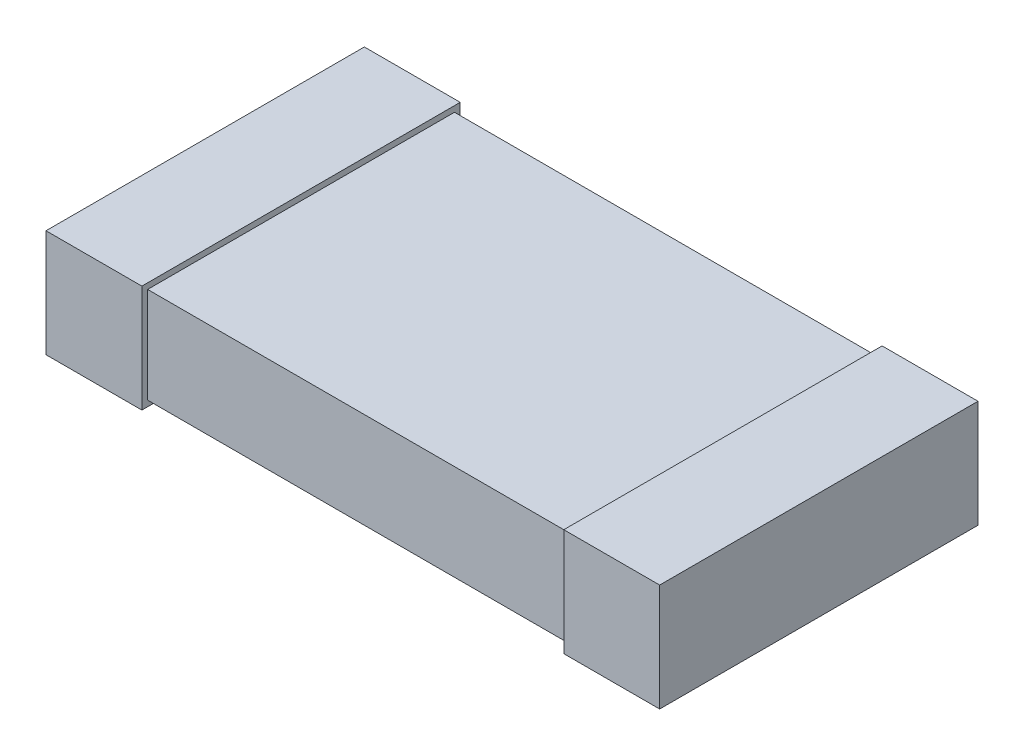
ISO-10303-21;
HEADER;
FILE_DESCRIPTION(('STEP AP214'),'2;1');
FILE_NAME('part.step','',(''),(''),'','','');
FILE_SCHEMA(('AUTOMOTIVE_DESIGN { 1 0 10303 214 1 1 1 1 }'));
ENDSEC;
DATA;
#1=APPLICATION_CONTEXT('core data for automotive mechanical design processes');
#2=APPLICATION_PROTOCOL_DEFINITION('international standard','automotive_design',2000,#1);
#3=PRODUCT_CONTEXT('',#1,'mechanical');
#4=PRODUCT('Part','Part','',(#3));
#5=PRODUCT_RELATED_PRODUCT_CATEGORY('part','',(#4));
#6=PRODUCT_DEFINITION_FORMATION('','',#4);
#7=PRODUCT_DEFINITION_CONTEXT('part definition',#1,'design');
#8=PRODUCT_DEFINITION('design','',#6,#7);
#9=PRODUCT_DEFINITION_SHAPE('','',#8);
#10=(LENGTH_UNIT() NAMED_UNIT(*) SI_UNIT(.MILLI.,.METRE.));
#11=(NAMED_UNIT(*) PLANE_ANGLE_UNIT() SI_UNIT($,.RADIAN.));
#12=(NAMED_UNIT(*) SI_UNIT($,.STERADIAN.) SOLID_ANGLE_UNIT());
#13=UNCERTAINTY_MEASURE_WITH_UNIT(LENGTH_MEASURE(1.E-05),#10,'distance_accuracy_value','');
#14=(GEOMETRIC_REPRESENTATION_CONTEXT(3) GLOBAL_UNCERTAINTY_ASSIGNED_CONTEXT((#13)) GLOBAL_UNIT_ASSIGNED_CONTEXT((#10,
#11,#12)) REPRESENTATION_CONTEXT('',''));
#15=CARTESIAN_POINT('',(0.,0.,0.));
#16=DIRECTION('',(0.,0.,1.));
#17=DIRECTION('',(1.,0.,0.));
#18=AXIS2_PLACEMENT_3D('',#15,#16,#17);
#19=CARTESIAN_POINT('',(-1.6,0.5,0.8));
#20=DIRECTION('',(0.,0.,-1.));
#21=DIRECTION('',(-1.,0.,0.));
#22=AXIS2_PLACEMENT_3D('',#19,#20,#21);
#23=PLANE('',#22);
#24=DIRECTION('',(0.,-1.,0.));
#25=VECTOR('',#24,1.);
#26=CARTESIAN_POINT('',(1.1,0.5,0.8));
#27=LINE('',#26,#25);
#28=CARTESIAN_POINT('',(1.1,0.5,0.8));
#29=VERTEX_POINT('',#28);
#30=CARTESIAN_POINT('',(1.1,0.,0.8));
#31=VERTEX_POINT('',#30);
#32=EDGE_CURVE('E51',#29,#31,#27,.T.);
#33=ORIENTED_EDGE('',*,*,#32,.F.);
#34=DIRECTION('',(1.,0.,0.));
#35=VECTOR('',#34,1.);
#36=CARTESIAN_POINT('',(-1.6,0.5,0.8));
#37=LINE('',#36,#35);
#38=CARTESIAN_POINT('',(-1.1,0.5,0.8));
#39=VERTEX_POINT('',#38);
#40=EDGE_CURVE('E216',#39,#29,#37,.T.);
#41=ORIENTED_EDGE('',*,*,#40,.F.);
#42=DIRECTION('',(0.,1.,0.));
#43=VECTOR('',#42,1.);
#44=CARTESIAN_POINT('',(-1.1,0.5,0.8));
#45=LINE('',#44,#43);
#46=CARTESIAN_POINT('',(-1.1,0.,0.8));
#47=VERTEX_POINT('',#46);
#48=EDGE_CURVE('E210',#47,#39,#45,.T.);
#49=ORIENTED_EDGE('',*,*,#48,.F.);
#50=DIRECTION('',(1.,0.,0.));
#51=VECTOR('',#50,1.);
#52=CARTESIAN_POINT('',(-1.6,0.,0.8));
#53=LINE('',#52,#51);
#54=EDGE_CURVE('E215',#47,#31,#53,.T.);
#55=ORIENTED_EDGE('',*,*,#54,.T.);
#56=EDGE_LOOP('',(#33,#41,#49,#55));
#57=FACE_BOUND('',#56,.T.);
#58=ADVANCED_FACE('F36',(#57),#23,.F.);
#59=CARTESIAN_POINT('',(-1.6,0.5,-0.8));
#60=DIRECTION('',(0.,0.,1.));
#61=DIRECTION('',(1.,0.,0.));
#62=AXIS2_PLACEMENT_3D('',#59,#60,#61);
#63=PLANE('',#62);
#64=DIRECTION('',(0.,1.,0.));
#65=VECTOR('',#64,1.);
#66=CARTESIAN_POINT('',(1.1,0.5,-0.8));
#67=LINE('',#66,#65);
#68=CARTESIAN_POINT('',(1.1,0.,-0.8));
#69=VERTEX_POINT('',#68);
#70=CARTESIAN_POINT('',(1.1,0.5,-0.8));
#71=VERTEX_POINT('',#70);
#72=EDGE_CURVE('E165',#69,#71,#67,.T.);
#73=ORIENTED_EDGE('',*,*,#72,.F.);
#74=DIRECTION('',(-1.,0.,0.));
#75=VECTOR('',#74,1.);
#76=CARTESIAN_POINT('',(-1.6,0.,-0.8));
#77=LINE('',#76,#75);
#78=CARTESIAN_POINT('',(-1.1,0.,-0.8));
#79=VERTEX_POINT('',#78);
#80=EDGE_CURVE('E219',#69,#79,#77,.T.);
#81=ORIENTED_EDGE('',*,*,#80,.T.);
#82=DIRECTION('',(0.,-1.,0.));
#83=VECTOR('',#82,1.);
#84=CARTESIAN_POINT('',(-1.1,0.5,-0.8));
#85=LINE('',#84,#83);
#86=CARTESIAN_POINT('',(-1.1,0.5,-0.8));
#87=VERTEX_POINT('',#86);
#88=EDGE_CURVE('E198',#87,#79,#85,.T.);
#89=ORIENTED_EDGE('',*,*,#88,.F.);
#90=DIRECTION('',(-1.,0.,0.));
#91=VECTOR('',#90,1.);
#92=CARTESIAN_POINT('',(-1.6,0.5,-0.8));
#93=LINE('',#92,#91);
#94=EDGE_CURVE('E218',#71,#87,#93,.T.);
#95=ORIENTED_EDGE('',*,*,#94,.F.);
#96=EDGE_LOOP('',(#73,#81,#89,#95));
#97=FACE_BOUND('',#96,.T.);
#98=ADVANCED_FACE('F236',(#97),#63,.F.);
#99=CARTESIAN_POINT('',(-1.6,0.5,0.8));
#100=DIRECTION('',(0.,1.,0.));
#101=DIRECTION('',(0.,0.,1.));
#102=AXIS2_PLACEMENT_3D('',#99,#100,#101);
#103=PLANE('',#102);
#104=ORIENTED_EDGE('',*,*,#40,.T.);
#105=DIRECTION('',(0.,0.,-1.));
#106=VECTOR('',#105,1.);
#107=CARTESIAN_POINT('',(1.1,0.5,0.8));
#108=LINE('',#107,#106);
#109=EDGE_CURVE('E58',#29,#71,#108,.T.);
#110=ORIENTED_EDGE('',*,*,#109,.T.);
#111=ORIENTED_EDGE('',*,*,#94,.T.);
#112=DIRECTION('',(0.,0.,1.));
#113=VECTOR('',#112,1.);
#114=CARTESIAN_POINT('',(-1.1,0.5,0.8));
#115=LINE('',#114,#113);
#116=EDGE_CURVE('E213',#87,#39,#115,.T.);
#117=ORIENTED_EDGE('',*,*,#116,.T.);
#118=EDGE_LOOP('',(#104,#110,#111,#117));
#119=FACE_BOUND('',#118,.T.);
#120=ADVANCED_FACE('F233',(#119),#103,.T.);
#121=CARTESIAN_POINT('',(-1.6,0.,0.8));
#122=DIRECTION('',(0.,1.,0.));
#123=DIRECTION('',(0.,0.,1.));
#124=AXIS2_PLACEMENT_3D('',#121,#122,#123);
#125=PLANE('',#124);
#126=DIRECTION('',(0.,0.,-1.));
#127=VECTOR('',#126,1.);
#128=CARTESIAN_POINT('',(1.1,0.,0.8));
#129=LINE('',#128,#127);
#130=EDGE_CURVE('E12',#31,#69,#129,.T.);
#131=ORIENTED_EDGE('',*,*,#130,.F.);
#132=ORIENTED_EDGE('',*,*,#54,.F.);
#133=DIRECTION('',(0.,0.,1.));
#134=VECTOR('',#133,1.);
#135=CARTESIAN_POINT('',(-1.1,0.,0.8));
#136=LINE('',#135,#134);
#137=EDGE_CURVE('E44',#79,#47,#136,.T.);
#138=ORIENTED_EDGE('',*,*,#137,.F.);
#139=ORIENTED_EDGE('',*,*,#80,.F.);
#140=EDGE_LOOP('',(#131,#132,#138,#139));
#141=FACE_BOUND('',#140,.T.);
#142=ADVANCED_FACE('F231',(#141),#125,.F.);
#143=CARTESIAN_POINT('',(-1.1,-0.03,1.61073297516494));
#144=DIRECTION('',(0.,1.,0.));
#145=DIRECTION('',(-1.,0.,0.));
#146=AXIS2_PLACEMENT_3D('',#143,#144,#145);
#147=PLANE('',#146);
#148=DIRECTION('',(0.,0.,-1.));
#149=VECTOR('',#148,1.);
#150=CARTESIAN_POINT('',(-1.1,-0.03,1.61073297516494));
#151=LINE('',#150,#149);
#152=CARTESIAN_POINT('',(-1.1,-0.03,0.83));
#153=VERTEX_POINT('',#152);
#154=CARTESIAN_POINT('',(-1.1,-0.03,-0.83));
#155=VERTEX_POINT('',#154);
#156=EDGE_CURVE('E187',#153,#155,#151,.T.);
#157=ORIENTED_EDGE('',*,*,#156,.F.);
#158=DIRECTION('',(-1.,0.,0.));
#159=VECTOR('',#158,1.);
#160=CARTESIAN_POINT('',(-1.1,-0.03,0.83));
#161=LINE('',#160,#159);
#162=CARTESIAN_POINT('',(-1.6,-0.0300000000000001,0.83));
#163=VERTEX_POINT('',#162);
#164=EDGE_CURVE('E192',#153,#163,#161,.T.);
#165=ORIENTED_EDGE('',*,*,#164,.T.);
#166=DIRECTION('',(0.,0.,-1.));
#167=VECTOR('',#166,1.);
#168=CARTESIAN_POINT('',(-1.6,-0.0300000000000001,1.61073297516494));
#169=LINE('',#168,#167);
#170=CARTESIAN_POINT('',(-1.6,-0.0300000000000001,-0.83));
#171=VERTEX_POINT('',#170);
#172=EDGE_CURVE('E200',#163,#171,#169,.T.);
#173=ORIENTED_EDGE('',*,*,#172,.T.);
#174=DIRECTION('',(-1.,0.,0.));
#175=VECTOR('',#174,1.);
#176=CARTESIAN_POINT('',(-1.1,-0.03,-0.83));
#177=LINE('',#176,#175);
#178=EDGE_CURVE('E178',#155,#171,#177,.T.);
#179=ORIENTED_EDGE('',*,*,#178,.F.);
#180=EDGE_LOOP('',(#157,#165,#173,#179));
#181=FACE_BOUND('',#180,.T.);
#182=ADVANCED_FACE('F277',(#181),#147,.F.);
#183=CARTESIAN_POINT('',(-1.1,0.53,1.61073297516494));
#184=DIRECTION('',(0.,-1.,0.));
#185=DIRECTION('',(1.,0.,0.));
#186=AXIS2_PLACEMENT_3D('',#183,#184,#185);
#187=PLANE('',#186);
#188=DIRECTION('',(0.,0.,-1.));
#189=VECTOR('',#188,1.);
#190=CARTESIAN_POINT('',(-1.6,0.53,1.61073297516494));
#191=LINE('',#190,#189);
#192=CARTESIAN_POINT('',(-1.6,0.53,0.83));
#193=VERTEX_POINT('',#192);
#194=CARTESIAN_POINT('',(-1.6,0.53,-0.83));
#195=VERTEX_POINT('',#194);
#196=EDGE_CURVE('E202',#193,#195,#191,.T.);
#197=ORIENTED_EDGE('',*,*,#196,.F.);
#198=DIRECTION('',(1.,0.,0.));
#199=VECTOR('',#198,1.);
#200=CARTESIAN_POINT('',(-1.1,0.53,0.83));
#201=LINE('',#200,#199);
#202=CARTESIAN_POINT('',(-1.1,0.53,0.83));
#203=VERTEX_POINT('',#202);
#204=EDGE_CURVE('E191',#193,#203,#201,.T.);
#205=ORIENTED_EDGE('',*,*,#204,.T.);
#206=DIRECTION('',(0.,0.,-1.));
#207=VECTOR('',#206,1.);
#208=CARTESIAN_POINT('',(-1.1,0.53,1.61073297516494));
#209=LINE('',#208,#207);
#210=CARTESIAN_POINT('',(-1.1,0.53,-0.83));
#211=VERTEX_POINT('',#210);
#212=EDGE_CURVE('E204',#203,#211,#209,.T.);
#213=ORIENTED_EDGE('',*,*,#212,.T.);
#214=DIRECTION('',(1.,0.,0.));
#215=VECTOR('',#214,1.);
#216=CARTESIAN_POINT('',(-1.1,0.53,-0.83));
#217=LINE('',#216,#215);
#218=EDGE_CURVE('E184',#195,#211,#217,.T.);
#219=ORIENTED_EDGE('',*,*,#218,.F.);
#220=EDGE_LOOP('',(#197,#205,#213,#219));
#221=FACE_BOUND('',#220,.T.);
#222=ADVANCED_FACE('F280',(#221),#187,.F.);
#223=CARTESIAN_POINT('',(-1.1,0.53,1.61073297516494));
#224=DIRECTION('',(-1.,0.,0.));
#225=DIRECTION('',(0.,0.,1.));
#226=AXIS2_PLACEMENT_3D('',#223,#224,#225);
#227=PLANE('',#226);
#228=ORIENTED_EDGE('',*,*,#116,.F.);
#229=ORIENTED_EDGE('',*,*,#88,.T.);
#230=ORIENTED_EDGE('',*,*,#137,.T.);
#231=ORIENTED_EDGE('',*,*,#48,.T.);
#232=EDGE_LOOP('',(#228,#229,#230,#231));
#233=FACE_BOUND('',#232,.T.);
#234=ORIENTED_EDGE('',*,*,#212,.F.);
#235=DIRECTION('',(0.,-1.,0.));
#236=VECTOR('',#235,1.);
#237=CARTESIAN_POINT('',(-1.1,0.53,0.83));
#238=LINE('',#237,#236);
#239=EDGE_CURVE('E195',#203,#153,#238,.T.);
#240=ORIENTED_EDGE('',*,*,#239,.T.);
#241=ORIENTED_EDGE('',*,*,#156,.T.);
#242=DIRECTION('',(0.,-1.,0.));
#243=VECTOR('',#242,1.);
#244=CARTESIAN_POINT('',(-1.1,0.53,-0.83));
#245=LINE('',#244,#243);
#246=EDGE_CURVE('E181',#211,#155,#245,.T.);
#247=ORIENTED_EDGE('',*,*,#246,.F.);
#248=EDGE_LOOP('',(#234,#240,#241,#247));
#249=FACE_BOUND('',#248,.T.);
#250=ADVANCED_FACE('F226',(#233,#249),#227,.F.);
#251=CARTESIAN_POINT('',(-1.6,0.5,0.83));
#252=DIRECTION('',(0.,0.,-1.));
#253=DIRECTION('',(-1.,0.,0.));
#254=AXIS2_PLACEMENT_3D('',#251,#252,#253);
#255=PLANE('',#254);
#256=ORIENTED_EDGE('',*,*,#204,.F.);
#257=DIRECTION('',(0.,1.,0.));
#258=VECTOR('',#257,1.);
#259=CARTESIAN_POINT('',(-1.6,0.53,0.83));
#260=LINE('',#259,#258);
#261=EDGE_CURVE('E188',#163,#193,#260,.T.);
#262=ORIENTED_EDGE('',*,*,#261,.F.);
#263=ORIENTED_EDGE('',*,*,#164,.F.);
#264=ORIENTED_EDGE('',*,*,#239,.F.);
#265=EDGE_LOOP('',(#256,#262,#263,#264));
#266=FACE_BOUND('',#265,.T.);
#267=ADVANCED_FACE('F272',(#266),#255,.F.);
#268=CARTESIAN_POINT('',(-1.6,0.5,-0.83));
#269=DIRECTION('',(0.,0.,1.));
#270=DIRECTION('',(1.,0.,0.));
#271=AXIS2_PLACEMENT_3D('',#268,#269,#270);
#272=PLANE('',#271);
#273=ORIENTED_EDGE('',*,*,#246,.T.);
#274=ORIENTED_EDGE('',*,*,#178,.T.);
#275=DIRECTION('',(0.,1.,0.));
#276=VECTOR('',#275,1.);
#277=CARTESIAN_POINT('',(-1.6,0.53,-0.83));
#278=LINE('',#277,#276);
#279=EDGE_CURVE('E175',#171,#195,#278,.T.);
#280=ORIENTED_EDGE('',*,*,#279,.T.);
#281=ORIENTED_EDGE('',*,*,#218,.T.);
#282=EDGE_LOOP('',(#273,#274,#280,#281));
#283=FACE_BOUND('',#282,.T.);
#284=ADVANCED_FACE('F269',(#283),#272,.F.);
#285=CARTESIAN_POINT('',(-1.6,0.5,-0.8));
#286=DIRECTION('',(1.,0.,0.));
#287=DIRECTION('',(0.,0.,-1.));
#288=AXIS2_PLACEMENT_3D('',#285,#286,#287);
#289=PLANE('',#288);
#290=ORIENTED_EDGE('',*,*,#172,.F.);
#291=ORIENTED_EDGE('',*,*,#261,.T.);
#292=ORIENTED_EDGE('',*,*,#196,.T.);
#293=ORIENTED_EDGE('',*,*,#279,.F.);
#294=EDGE_LOOP('',(#290,#291,#292,#293));
#295=FACE_BOUND('',#294,.T.);
#296=ADVANCED_FACE('F38',(#295),#289,.F.);
#297=CARTESIAN_POINT('',(1.1,-0.0299999999999997,1.61073297516494));
#298=DIRECTION('',(0.,1.,0.));
#299=DIRECTION('',(-1.,0.,0.));
#300=AXIS2_PLACEMENT_3D('',#297,#298,#299);
#301=PLANE('',#300);
#302=DIRECTION('',(0.,0.,-1.));
#303=VECTOR('',#302,1.);
#304=CARTESIAN_POINT('',(1.6,-0.0299999999999997,1.61073297516494));
#305=LINE('',#304,#303);
#306=CARTESIAN_POINT('',(1.6,-0.0299999999999997,0.83));
#307=VERTEX_POINT('',#306);
#308=CARTESIAN_POINT('',(1.6,-0.0299999999999997,-0.83));
#309=VERTEX_POINT('',#308);
#310=EDGE_CURVE('E138',#307,#309,#305,.T.);
#311=ORIENTED_EDGE('',*,*,#310,.F.);
#312=DIRECTION('',(-1.,0.,0.));
#313=VECTOR('',#312,1.);
#314=CARTESIAN_POINT('',(1.1,-0.0299999999999997,0.83));
#315=LINE('',#314,#313);
#316=CARTESIAN_POINT('',(1.1,-0.0299999999999997,0.83));
#317=VERTEX_POINT('',#316);
#318=EDGE_CURVE('E133',#307,#317,#315,.T.);
#319=ORIENTED_EDGE('',*,*,#318,.T.);
#320=DIRECTION('',(0.,0.,-1.));
#321=VECTOR('',#320,1.);
#322=CARTESIAN_POINT('',(1.1,-0.0299999999999997,1.61073297516494));
#323=LINE('',#322,#321);
#324=CARTESIAN_POINT('',(1.1,-0.0299999999999997,-0.83));
#325=VERTEX_POINT('',#324);
#326=EDGE_CURVE('E128',#317,#325,#323,.T.);
#327=ORIENTED_EDGE('',*,*,#326,.T.);
#328=DIRECTION('',(-1.,0.,0.));
#329=VECTOR('',#328,1.);
#330=CARTESIAN_POINT('',(1.1,-0.0299999999999997,-0.83));
#331=LINE('',#330,#329);
#332=EDGE_CURVE('E132',#309,#325,#331,.T.);
#333=ORIENTED_EDGE('',*,*,#332,.F.);
#334=EDGE_LOOP('',(#311,#319,#327,#333));
#335=FACE_BOUND('',#334,.T.);
#336=ADVANCED_FACE('F131',(#335),#301,.F.);
#337=CARTESIAN_POINT('',(1.1,0.53,1.61073297516494));
#338=DIRECTION('',(1.,0.,0.));
#339=DIRECTION('',(0.,0.,-1.));
#340=AXIS2_PLACEMENT_3D('',#337,#338,#339);
#341=PLANE('',#340);
#342=ORIENTED_EDGE('',*,*,#109,.F.);
#343=ORIENTED_EDGE('',*,*,#32,.T.);
#344=ORIENTED_EDGE('',*,*,#130,.T.);
#345=ORIENTED_EDGE('',*,*,#72,.T.);
#346=EDGE_LOOP('',(#342,#343,#344,#345));
#347=FACE_BOUND('',#346,.T.);
#348=ORIENTED_EDGE('',*,*,#326,.F.);
#349=DIRECTION('',(0.,1.,0.));
#350=VECTOR('',#349,1.);
#351=CARTESIAN_POINT('',(1.1,0.53,0.83));
#352=LINE('',#351,#350);
#353=CARTESIAN_POINT('',(1.1,0.53,0.83));
#354=VERTEX_POINT('',#353);
#355=EDGE_CURVE('E160',#317,#354,#352,.T.);
#356=ORIENTED_EDGE('',*,*,#355,.T.);
#357=DIRECTION('',(0.,0.,-1.));
#358=VECTOR('',#357,1.);
#359=CARTESIAN_POINT('',(1.1,0.53,1.61073297516494));
#360=LINE('',#359,#358);
#361=CARTESIAN_POINT('',(1.1,0.53,-0.83));
#362=VERTEX_POINT('',#361);
#363=EDGE_CURVE('E137',#354,#362,#360,.T.);
#364=ORIENTED_EDGE('',*,*,#363,.T.);
#365=DIRECTION('',(0.,1.,0.));
#366=VECTOR('',#365,1.);
#367=CARTESIAN_POINT('',(1.1,0.53,-0.83));
#368=LINE('',#367,#366);
#369=EDGE_CURVE('E145',#325,#362,#368,.T.);
#370=ORIENTED_EDGE('',*,*,#369,.F.);
#371=EDGE_LOOP('',(#348,#356,#364,#370));
#372=FACE_BOUND('',#371,.T.);
#373=ADVANCED_FACE('F150',(#347,#372),#341,.F.);
#374=CARTESIAN_POINT('',(1.1,0.53,1.61073297516494));
#375=DIRECTION('',(0.,-1.,0.));
#376=DIRECTION('',(1.,0.,0.));
#377=AXIS2_PLACEMENT_3D('',#374,#375,#376);
#378=PLANE('',#377);
#379=ORIENTED_EDGE('',*,*,#363,.F.);
#380=DIRECTION('',(1.,0.,0.));
#381=VECTOR('',#380,1.);
#382=CARTESIAN_POINT('',(1.1,0.53,0.83));
#383=LINE('',#382,#381);
#384=CARTESIAN_POINT('',(1.6,0.53,0.83));
#385=VERTEX_POINT('',#384);
#386=EDGE_CURVE('E163',#354,#385,#383,.T.);
#387=ORIENTED_EDGE('',*,*,#386,.T.);
#388=DIRECTION('',(0.,0.,-1.));
#389=VECTOR('',#388,1.);
#390=CARTESIAN_POINT('',(1.6,0.53,1.61073297516494));
#391=LINE('',#390,#389);
#392=CARTESIAN_POINT('',(1.6,0.53,-0.83));
#393=VERTEX_POINT('',#392);
#394=EDGE_CURVE('E152',#385,#393,#391,.T.);
#395=ORIENTED_EDGE('',*,*,#394,.T.);
#396=DIRECTION('',(1.,0.,0.));
#397=VECTOR('',#396,1.);
#398=CARTESIAN_POINT('',(1.1,0.53,-0.83));
#399=LINE('',#398,#397);
#400=EDGE_CURVE('E153',#362,#393,#399,.T.);
#401=ORIENTED_EDGE('',*,*,#400,.F.);
#402=EDGE_LOOP('',(#379,#387,#395,#401));
#403=FACE_BOUND('',#402,.T.);
#404=ADVANCED_FACE('F256',(#403),#378,.F.);
#405=CARTESIAN_POINT('',(-1.6,0.5,0.83));
#406=DIRECTION('',(0.,0.,-1.));
#407=DIRECTION('',(-1.,0.,0.));
#408=AXIS2_PLACEMENT_3D('',#405,#406,#407);
#409=PLANE('',#408);
#410=ORIENTED_EDGE('',*,*,#355,.F.);
#411=ORIENTED_EDGE('',*,*,#318,.F.);
#412=DIRECTION('',(0.,-1.,0.));
#413=VECTOR('',#412,1.);
#414=CARTESIAN_POINT('',(1.6,0.53,0.83));
#415=LINE('',#414,#413);
#416=EDGE_CURVE('E161',#385,#307,#415,.T.);
#417=ORIENTED_EDGE('',*,*,#416,.F.);
#418=ORIENTED_EDGE('',*,*,#386,.F.);
#419=EDGE_LOOP('',(#410,#411,#417,#418));
#420=FACE_BOUND('',#419,.T.);
#421=ADVANCED_FACE('F252',(#420),#409,.F.);
#422=CARTESIAN_POINT('',(-1.6,0.5,-0.83));
#423=DIRECTION('',(0.,0.,1.));
#424=DIRECTION('',(1.,0.,0.));
#425=AXIS2_PLACEMENT_3D('',#422,#423,#424);
#426=PLANE('',#425);
#427=ORIENTED_EDGE('',*,*,#400,.T.);
#428=DIRECTION('',(0.,-1.,0.));
#429=VECTOR('',#428,1.);
#430=CARTESIAN_POINT('',(1.6,0.53,-0.83));
#431=LINE('',#430,#429);
#432=EDGE_CURVE('E148',#393,#309,#431,.T.);
#433=ORIENTED_EDGE('',*,*,#432,.T.);
#434=ORIENTED_EDGE('',*,*,#332,.T.);
#435=ORIENTED_EDGE('',*,*,#369,.T.);
#436=EDGE_LOOP('',(#427,#433,#434,#435));
#437=FACE_BOUND('',#436,.T.);
#438=ADVANCED_FACE('F144',(#437),#426,.F.);
#439=CARTESIAN_POINT('',(1.6,0.5,-0.8));
#440=DIRECTION('',(-1.,0.,0.));
#441=DIRECTION('',(0.,0.,1.));
#442=AXIS2_PLACEMENT_3D('',#439,#440,#441);
#443=PLANE('',#442);
#444=ORIENTED_EDGE('',*,*,#394,.F.);
#445=ORIENTED_EDGE('',*,*,#416,.T.);
#446=ORIENTED_EDGE('',*,*,#310,.T.);
#447=ORIENTED_EDGE('',*,*,#432,.F.);
#448=EDGE_LOOP('',(#444,#445,#446,#447));
#449=FACE_BOUND('',#448,.T.);
#450=ADVANCED_FACE('F246',(#449),#443,.F.);
#451=CLOSED_SHELL('',(#58,#98,#120,#142,#182,#222,#250,#267,#284,#296,#336,#373,#404,#421,#438,#450));
#452=MANIFOLD_SOLID_BREP('B2',#451);
#453=ADVANCED_BREP_SHAPE_REPRESENTATION('',(#18,#452),#14);
#454=SHAPE_DEFINITION_REPRESENTATION(#9,#453);
ENDSEC;
END-ISO-10303-21;
